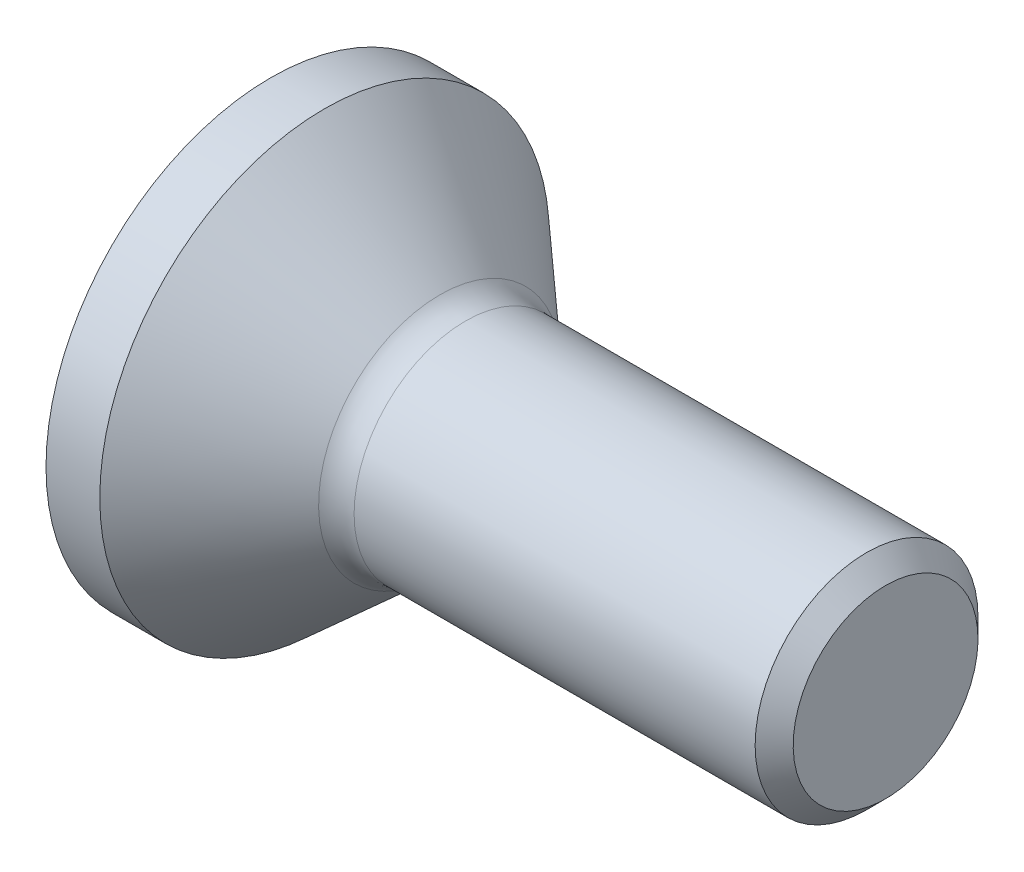
ISO-10303-21;
HEADER;
FILE_DESCRIPTION(('STEP AP214'),'2;1');
FILE_NAME('part.step','',(''),(''),'','','');
FILE_SCHEMA(('AUTOMOTIVE_DESIGN { 1 0 10303 214 1 1 1 1 }'));
ENDSEC;
DATA;
#1=APPLICATION_CONTEXT('core data for automotive mechanical design processes');
#2=APPLICATION_PROTOCOL_DEFINITION('international standard','automotive_design',2000,#1);
#3=PRODUCT_CONTEXT('',#1,'mechanical');
#4=PRODUCT('Part','Part','',(#3));
#5=PRODUCT_RELATED_PRODUCT_CATEGORY('part','',(#4));
#6=PRODUCT_DEFINITION_FORMATION('','',#4);
#7=PRODUCT_DEFINITION_CONTEXT('part definition',#1,'design');
#8=PRODUCT_DEFINITION('design','',#6,#7);
#9=PRODUCT_DEFINITION_SHAPE('','',#8);
#10=(LENGTH_UNIT() NAMED_UNIT(*) SI_UNIT(.MILLI.,.METRE.));
#11=(NAMED_UNIT(*) PLANE_ANGLE_UNIT() SI_UNIT($,.RADIAN.));
#12=(NAMED_UNIT(*) SI_UNIT($,.STERADIAN.) SOLID_ANGLE_UNIT());
#13=UNCERTAINTY_MEASURE_WITH_UNIT(LENGTH_MEASURE(1.E-05),#10,'distance_accuracy_value','');
#14=(GEOMETRIC_REPRESENTATION_CONTEXT(3) GLOBAL_UNCERTAINTY_ASSIGNED_CONTEXT((#13)) GLOBAL_UNIT_ASSIGNED_CONTEXT((#10,
#11,#12)) REPRESENTATION_CONTEXT('',''));
#15=CARTESIAN_POINT('',(0.,0.,0.));
#16=DIRECTION('',(0.,0.,1.));
#17=DIRECTION('',(1.,0.,0.));
#18=AXIS2_PLACEMENT_3D('',#15,#16,#17);
#19=CARTESIAN_POINT('',(2.53407314718428,0.,0.));
#20=DIRECTION('',(1.,0.,0.));
#21=DIRECTION('',(0.,1.,0.));
#22=AXIS2_PLACEMENT_3D('',#19,#20,#21);
#23=TOROIDAL_SURFACE('',#22,1.95,0.5);
#24=CARTESIAN_POINT('',(2.2,0.,0.));
#25=DIRECTION('',(1.,0.,0.));
#26=DIRECTION('',(0.,1.,0.));
#27=AXIS2_PLACEMENT_3D('',#24,#25,#26);
#28=CIRCLE('',#27,1.57798503749125);
#29=CARTESIAN_POINT('',(2.2,1.57798503749125,0.));
#30=VERTEX_POINT('',#29);
#31=EDGE_CURVE('E134',#30,#30,#28,.T.);
#32=ORIENTED_EDGE('',*,*,#31,.T.);
#33=EDGE_LOOP('',(#32));
#34=FACE_BOUND('',#33,.T.);
#35=CARTESIAN_POINT('',(2.53407314718428,0.,0.));
#36=DIRECTION('',(1.,0.,0.));
#37=DIRECTION('',(0.,1.,0.));
#38=AXIS2_PLACEMENT_3D('',#35,#36,#37);
#39=CIRCLE('',#38,1.45);
#40=CARTESIAN_POINT('',(2.53407314718428,1.45,0.));
#41=VERTEX_POINT('',#40);
#42=EDGE_CURVE('E11',#41,#41,#39,.T.);
#43=ORIENTED_EDGE('',*,*,#42,.F.);
#44=EDGE_LOOP('',(#43));
#45=FACE_BOUND('',#44,.T.);
#46=ADVANCED_FACE('F33',(#34,#45),#23,.F.);
#47=CARTESIAN_POINT('',(0.,0.,0.));
#48=DIRECTION('',(1.,0.,0.));
#49=DIRECTION('',(0.,1.,0.));
#50=AXIS2_PLACEMENT_3D('',#47,#48,#49);
#51=CYLINDRICAL_SURFACE('',#50,1.45);
#52=ORIENTED_EDGE('',*,*,#42,.T.);
#53=EDGE_LOOP('',(#52));
#54=FACE_BOUND('',#53,.T.);
#55=CARTESIAN_POINT('',(7.75251262658471,0.,0.));
#56=DIRECTION('',(1.,0.,0.));
#57=DIRECTION('',(0.,1.,0.));
#58=AXIS2_PLACEMENT_3D('',#55,#56,#57);
#59=CIRCLE('',#58,1.45);
#60=CARTESIAN_POINT('',(7.75251262658471,1.45,0.));
#61=VERTEX_POINT('',#60);
#62=EDGE_CURVE('E40',#61,#61,#59,.T.);
#63=ORIENTED_EDGE('',*,*,#62,.F.);
#64=EDGE_LOOP('',(#63));
#65=FACE_BOUND('',#64,.T.);
#66=ADVANCED_FACE('F156',(#54,#65),#51,.T.);
#67=CARTESIAN_POINT('',(8.,0.,0.));
#68=DIRECTION('',(-1.,0.,0.));
#69=DIRECTION('',(0.,-1.,0.));
#70=AXIS2_PLACEMENT_3D('',#67,#68,#69);
#71=CONICAL_SURFACE('',#70,1.20251262658471,0.785398163397447);
#72=ORIENTED_EDGE('',*,*,#62,.T.);
#73=EDGE_LOOP('',(#72));
#74=FACE_BOUND('',#73,.T.);
#75=CARTESIAN_POINT('',(8.,0.,0.));
#76=DIRECTION('',(1.,0.,0.));
#77=DIRECTION('',(0.,1.,0.));
#78=AXIS2_PLACEMENT_3D('',#75,#76,#77);
#79=CIRCLE('',#78,1.20251262658471);
#80=CARTESIAN_POINT('',(8.,1.20251262658471,0.));
#81=VERTEX_POINT('',#80);
#82=EDGE_CURVE('E148',#81,#81,#79,.T.);
#83=ORIENTED_EDGE('',*,*,#82,.F.);
#84=EDGE_LOOP('',(#83));
#85=FACE_BOUND('',#84,.T.);
#86=ADVANCED_FACE('F153',(#74,#85),#71,.T.);
#87=CARTESIAN_POINT('',(8.,1.20251262658471,0.));
#88=DIRECTION('',(1.,0.,0.));
#89=DIRECTION('',(0.,1.,0.));
#90=AXIS2_PLACEMENT_3D('',#87,#88,#89);
#91=PLANE('',#90);
#92=ORIENTED_EDGE('',*,*,#82,.T.);
#93=EDGE_LOOP('',(#92));
#94=FACE_BOUND('',#93,.T.);
#95=ADVANCED_FACE('F163',(#94),#91,.T.);
#96=CARTESIAN_POINT('',(0.,2.925,0.));
#97=DIRECTION('',(-1.,0.,0.));
#98=DIRECTION('',(0.,-1.,0.));
#99=AXIS2_PLACEMENT_3D('',#96,#97,#98);
#100=PLANE('',#99);
#101=DIRECTION('',(0.,1.,0.));
#102=VECTOR('',#101,1.);
#103=CARTESIAN_POINT('',(0.,-0.577350269189626,1.));
#104=LINE('',#103,#102);
#105=CARTESIAN_POINT('',(0.,-0.577350269189626,1.));
#106=VERTEX_POINT('',#105);
#107=CARTESIAN_POINT('',(0.,0.577350269189626,1.));
#108=VERTEX_POINT('',#107);
#109=EDGE_CURVE('E47',#106,#108,#104,.T.);
#110=ORIENTED_EDGE('',*,*,#109,.F.);
#111=DIRECTION('',(0.,0.5,0.866025403784439));
#112=VECTOR('',#111,1.);
#113=CARTESIAN_POINT('',(0.,-1.15470053837925,0.));
#114=LINE('',#113,#112);
#115=CARTESIAN_POINT('',(0.,-1.15470053837925,0.));
#116=VERTEX_POINT('',#115);
#117=EDGE_CURVE('E130',#116,#106,#114,.T.);
#118=ORIENTED_EDGE('',*,*,#117,.F.);
#119=DIRECTION('',(0.,-0.5,0.866025403784439));
#120=VECTOR('',#119,1.);
#121=CARTESIAN_POINT('',(0.,-0.577350269189626,-0.999999999999999));
#122=LINE('',#121,#120);
#123=CARTESIAN_POINT('',(0.,-0.577350269189626,-0.999999999999999));
#124=VERTEX_POINT('',#123);
#125=EDGE_CURVE('E128',#124,#116,#122,.T.);
#126=ORIENTED_EDGE('',*,*,#125,.F.);
#127=DIRECTION('',(0.,-1.,0.));
#128=VECTOR('',#127,1.);
#129=CARTESIAN_POINT('',(0.,0.577350269189626,-1.));
#130=LINE('',#129,#128);
#131=CARTESIAN_POINT('',(0.,0.577350269189626,-1.));
#132=VERTEX_POINT('',#131);
#133=EDGE_CURVE('E95',#132,#124,#130,.T.);
#134=ORIENTED_EDGE('',*,*,#133,.F.);
#135=DIRECTION('',(0.,-0.5,-0.866025403784439));
#136=VECTOR('',#135,1.);
#137=CARTESIAN_POINT('',(0.,1.15470053837925,0.));
#138=LINE('',#137,#136);
#139=CARTESIAN_POINT('',(0.,1.15470053837925,0.));
#140=VERTEX_POINT('',#139);
#141=EDGE_CURVE('E124',#140,#132,#138,.T.);
#142=ORIENTED_EDGE('',*,*,#141,.F.);
#143=DIRECTION('',(0.,0.5,-0.866025403784438));
#144=VECTOR('',#143,1.);
#145=CARTESIAN_POINT('',(0.,0.577350269189626,1.));
#146=LINE('',#145,#144);
#147=EDGE_CURVE('E121',#108,#140,#146,.T.);
#148=ORIENTED_EDGE('',*,*,#147,.F.);
#149=EDGE_LOOP('',(#110,#118,#126,#134,#142,#148));
#150=FACE_BOUND('',#149,.T.);
#151=CARTESIAN_POINT('',(0.,0.,0.));
#152=DIRECTION('',(1.,0.,0.));
#153=DIRECTION('',(0.,1.,0.));
#154=AXIS2_PLACEMENT_3D('',#151,#152,#153);
#155=CIRCLE('',#154,2.925);
#156=CARTESIAN_POINT('',(0.,2.925,0.));
#157=VERTEX_POINT('',#156);
#158=EDGE_CURVE('E145',#157,#157,#155,.T.);
#159=ORIENTED_EDGE('',*,*,#158,.F.);
#160=EDGE_LOOP('',(#159));
#161=FACE_BOUND('',#160,.T.);
#162=ADVANCED_FACE('F169',(#150,#161),#100,.T.);
#163=CARTESIAN_POINT('',(0.,0.,0.));
#164=DIRECTION('',(1.,0.,0.));
#165=DIRECTION('',(0.,1.,0.));
#166=AXIS2_PLACEMENT_3D('',#163,#164,#165);
#167=CYLINDRICAL_SURFACE('',#166,2.925);
#168=ORIENTED_EDGE('',*,*,#158,.T.);
#169=EDGE_LOOP('',(#168));
#170=FACE_BOUND('',#169,.T.);
#171=CARTESIAN_POINT('',(0.7,0.,0.));
#172=DIRECTION('',(1.,0.,0.));
#173=DIRECTION('',(0.,1.,0.));
#174=AXIS2_PLACEMENT_3D('',#171,#172,#173);
#175=CIRCLE('',#174,2.925);
#176=CARTESIAN_POINT('',(0.7,2.925,0.));
#177=VERTEX_POINT('',#176);
#178=EDGE_CURVE('E142',#177,#177,#175,.T.);
#179=ORIENTED_EDGE('',*,*,#178,.F.);
#180=EDGE_LOOP('',(#179));
#181=FACE_BOUND('',#180,.T.);
#182=ADVANCED_FACE('F173',(#170,#181),#167,.T.);
#183=CARTESIAN_POINT('',(2.2,0.,0.));
#184=DIRECTION('',(-1.,0.,0.));
#185=DIRECTION('',(0.,-1.,0.));
#186=AXIS2_PLACEMENT_3D('',#183,#184,#185);
#187=CONICAL_SURFACE('',#186,1.57798503749125,0.731714551896824);
#188=ORIENTED_EDGE('',*,*,#178,.T.);
#189=EDGE_LOOP('',(#188));
#190=FACE_BOUND('',#189,.T.);
#191=ORIENTED_EDGE('',*,*,#31,.F.);
#192=EDGE_LOOP('',(#191));
#193=FACE_BOUND('',#192,.T.);
#194=ADVANCED_FACE('F177',(#190,#193),#187,.T.);
#195=CARTESIAN_POINT('',(1.5,-0.577350269189626,1.));
#196=DIRECTION('',(0.,0.,1.));
#197=DIRECTION('',(0.,-1.,0.));
#198=AXIS2_PLACEMENT_3D('',#195,#196,#197);
#199=PLANE('',#198);
#200=ORIENTED_EDGE('',*,*,#109,.T.);
#201=DIRECTION('',(-1.,0.,0.));
#202=VECTOR('',#201,1.);
#203=CARTESIAN_POINT('',(1.5,0.577350269189626,1.));
#204=LINE('',#203,#202);
#205=CARTESIAN_POINT('',(1.5,0.577350269189626,1.));
#206=VERTEX_POINT('',#205);
#207=EDGE_CURVE('E77',#206,#108,#204,.T.);
#208=ORIENTED_EDGE('',*,*,#207,.F.);
#209=DIRECTION('',(0.,1.,0.));
#210=VECTOR('',#209,1.);
#211=CARTESIAN_POINT('',(1.5,-0.577350269189626,1.));
#212=LINE('',#211,#210);
#213=CARTESIAN_POINT('',(1.5,-0.577350269189626,1.));
#214=VERTEX_POINT('',#213);
#215=EDGE_CURVE('E132',#214,#206,#212,.T.);
#216=ORIENTED_EDGE('',*,*,#215,.F.);
#217=DIRECTION('',(-1.,0.,0.));
#218=VECTOR('',#217,1.);
#219=CARTESIAN_POINT('',(1.5,-0.577350269189626,1.));
#220=LINE('',#219,#218);
#221=EDGE_CURVE('E55',#214,#106,#220,.T.);
#222=ORIENTED_EDGE('',*,*,#221,.T.);
#223=EDGE_LOOP('',(#200,#208,#216,#222));
#224=FACE_BOUND('',#223,.T.);
#225=ADVANCED_FACE('F181',(#224),#199,.F.);
#226=CARTESIAN_POINT('',(1.5,-1.15470053837925,0.));
#227=DIRECTION('',(0.,-0.866025403784439,0.5));
#228=DIRECTION('',(0.,-0.5,-0.866025403784439));
#229=AXIS2_PLACEMENT_3D('',#226,#227,#228);
#230=PLANE('',#229);
#231=ORIENTED_EDGE('',*,*,#117,.T.);
#232=ORIENTED_EDGE('',*,*,#221,.F.);
#233=DIRECTION('',(0.,0.5,0.866025403784439));
#234=VECTOR('',#233,1.);
#235=CARTESIAN_POINT('',(1.5,-1.15470053837925,0.));
#236=LINE('',#235,#234);
#237=CARTESIAN_POINT('',(1.5,-1.15470053837925,0.));
#238=VERTEX_POINT('',#237);
#239=EDGE_CURVE('E107',#238,#214,#236,.T.);
#240=ORIENTED_EDGE('',*,*,#239,.F.);
#241=DIRECTION('',(-1.,0.,0.));
#242=VECTOR('',#241,1.);
#243=CARTESIAN_POINT('',(1.5,-1.15470053837925,0.));
#244=LINE('',#243,#242);
#245=EDGE_CURVE('E99',#238,#116,#244,.T.);
#246=ORIENTED_EDGE('',*,*,#245,.T.);
#247=EDGE_LOOP('',(#231,#232,#240,#246));
#248=FACE_BOUND('',#247,.T.);
#249=ADVANCED_FACE('F185',(#248),#230,.F.);
#250=CARTESIAN_POINT('',(1.5,-0.577350269189626,-0.999999999999999));
#251=DIRECTION('',(0.,-0.866025403784439,-0.5));
#252=DIRECTION('',(0.,0.5,-0.866025403784439));
#253=AXIS2_PLACEMENT_3D('',#250,#251,#252);
#254=PLANE('',#253);
#255=ORIENTED_EDGE('',*,*,#125,.T.);
#256=ORIENTED_EDGE('',*,*,#245,.F.);
#257=DIRECTION('',(0.,-0.5,0.866025403784439));
#258=VECTOR('',#257,1.);
#259=CARTESIAN_POINT('',(1.5,-0.577350269189626,-0.999999999999999));
#260=LINE('',#259,#258);
#261=CARTESIAN_POINT('',(1.5,-0.577350269189626,-0.999999999999999));
#262=VERTEX_POINT('',#261);
#263=EDGE_CURVE('E103',#262,#238,#260,.T.);
#264=ORIENTED_EDGE('',*,*,#263,.F.);
#265=DIRECTION('',(-1.,0.,0.));
#266=VECTOR('',#265,1.);
#267=CARTESIAN_POINT('',(1.5,-0.577350269189626,-0.999999999999999));
#268=LINE('',#267,#266);
#269=EDGE_CURVE('E88',#262,#124,#268,.T.);
#270=ORIENTED_EDGE('',*,*,#269,.T.);
#271=EDGE_LOOP('',(#255,#256,#264,#270));
#272=FACE_BOUND('',#271,.T.);
#273=ADVANCED_FACE('F104',(#272),#254,.F.);
#274=CARTESIAN_POINT('',(1.5,0.577350269189626,-1.));
#275=DIRECTION('',(0.,0.,-1.));
#276=DIRECTION('',(0.,1.,0.));
#277=AXIS2_PLACEMENT_3D('',#274,#275,#276);
#278=PLANE('',#277);
#279=ORIENTED_EDGE('',*,*,#133,.T.);
#280=ORIENTED_EDGE('',*,*,#269,.F.);
#281=DIRECTION('',(0.,-1.,0.));
#282=VECTOR('',#281,1.);
#283=CARTESIAN_POINT('',(1.5,0.577350269189626,-1.));
#284=LINE('',#283,#282);
#285=CARTESIAN_POINT('',(1.5,0.577350269189626,-1.));
#286=VERTEX_POINT('',#285);
#287=EDGE_CURVE('E92',#286,#262,#284,.T.);
#288=ORIENTED_EDGE('',*,*,#287,.F.);
#289=DIRECTION('',(-1.,0.,0.));
#290=VECTOR('',#289,1.);
#291=CARTESIAN_POINT('',(1.5,0.577350269189626,-1.));
#292=LINE('',#291,#290);
#293=EDGE_CURVE('E100',#286,#132,#292,.T.);
#294=ORIENTED_EDGE('',*,*,#293,.T.);
#295=EDGE_LOOP('',(#279,#280,#288,#294));
#296=FACE_BOUND('',#295,.T.);
#297=ADVANCED_FACE('F90',(#296),#278,.F.);
#298=CARTESIAN_POINT('',(1.5,1.15470053837925,0.));
#299=DIRECTION('',(0.,0.866025403784439,-0.5));
#300=DIRECTION('',(0.,0.5,0.866025403784439));
#301=AXIS2_PLACEMENT_3D('',#298,#299,#300);
#302=PLANE('',#301);
#303=ORIENTED_EDGE('',*,*,#141,.T.);
#304=ORIENTED_EDGE('',*,*,#293,.F.);
#305=DIRECTION('',(0.,-0.5,-0.866025403784439));
#306=VECTOR('',#305,1.);
#307=CARTESIAN_POINT('',(1.5,1.15470053837925,0.));
#308=LINE('',#307,#306);
#309=CARTESIAN_POINT('',(1.5,1.15470053837925,0.));
#310=VERTEX_POINT('',#309);
#311=EDGE_CURVE('E113',#310,#286,#308,.T.);
#312=ORIENTED_EDGE('',*,*,#311,.F.);
#313=DIRECTION('',(-1.,0.,0.));
#314=VECTOR('',#313,1.);
#315=CARTESIAN_POINT('',(1.5,1.15470053837925,0.));
#316=LINE('',#315,#314);
#317=EDGE_CURVE('E137',#310,#140,#316,.T.);
#318=ORIENTED_EDGE('',*,*,#317,.T.);
#319=EDGE_LOOP('',(#303,#304,#312,#318));
#320=FACE_BOUND('',#319,.T.);
#321=ADVANCED_FACE('F189',(#320),#302,.F.);
#322=CARTESIAN_POINT('',(1.5,0.577350269189626,1.));
#323=DIRECTION('',(0.,0.866025403784439,0.5));
#324=DIRECTION('',(0.,-0.5,0.866025403784439));
#325=AXIS2_PLACEMENT_3D('',#322,#323,#324);
#326=PLANE('',#325);
#327=ORIENTED_EDGE('',*,*,#147,.T.);
#328=ORIENTED_EDGE('',*,*,#317,.F.);
#329=DIRECTION('',(0.,0.5,-0.866025403784438));
#330=VECTOR('',#329,1.);
#331=CARTESIAN_POINT('',(1.5,0.577350269189626,1.));
#332=LINE('',#331,#330);
#333=EDGE_CURVE('E115',#206,#310,#332,.T.);
#334=ORIENTED_EDGE('',*,*,#333,.F.);
#335=ORIENTED_EDGE('',*,*,#207,.T.);
#336=EDGE_LOOP('',(#327,#328,#334,#335));
#337=FACE_BOUND('',#336,.T.);
#338=ADVANCED_FACE('F186',(#337),#326,.F.);
#339=CARTESIAN_POINT('',(1.5,0.,0.));
#340=DIRECTION('',(-1.,0.,0.));
#341=DIRECTION('',(0.,-1.,0.));
#342=AXIS2_PLACEMENT_3D('',#339,#340,#341);
#343=PLANE('',#342);
#344=ORIENTED_EDGE('',*,*,#215,.T.);
#345=ORIENTED_EDGE('',*,*,#333,.T.);
#346=ORIENTED_EDGE('',*,*,#311,.T.);
#347=ORIENTED_EDGE('',*,*,#287,.T.);
#348=ORIENTED_EDGE('',*,*,#263,.T.);
#349=ORIENTED_EDGE('',*,*,#239,.T.);
#350=EDGE_LOOP('',(#344,#345,#346,#347,#348,#349));
#351=FACE_BOUND('',#350,.T.);
#352=ADVANCED_FACE('F110',(#351),#343,.T.);
#353=CLOSED_SHELL('',(#46,#66,#86,#95,#162,#182,#194,#225,#249,#273,#297,#321,#338,#352));
#354=MANIFOLD_SOLID_BREP('B2',#353);
#355=ADVANCED_BREP_SHAPE_REPRESENTATION('',(#18,#354),#14);
#356=SHAPE_DEFINITION_REPRESENTATION(#9,#355);
ENDSEC;
END-ISO-10303-21;
